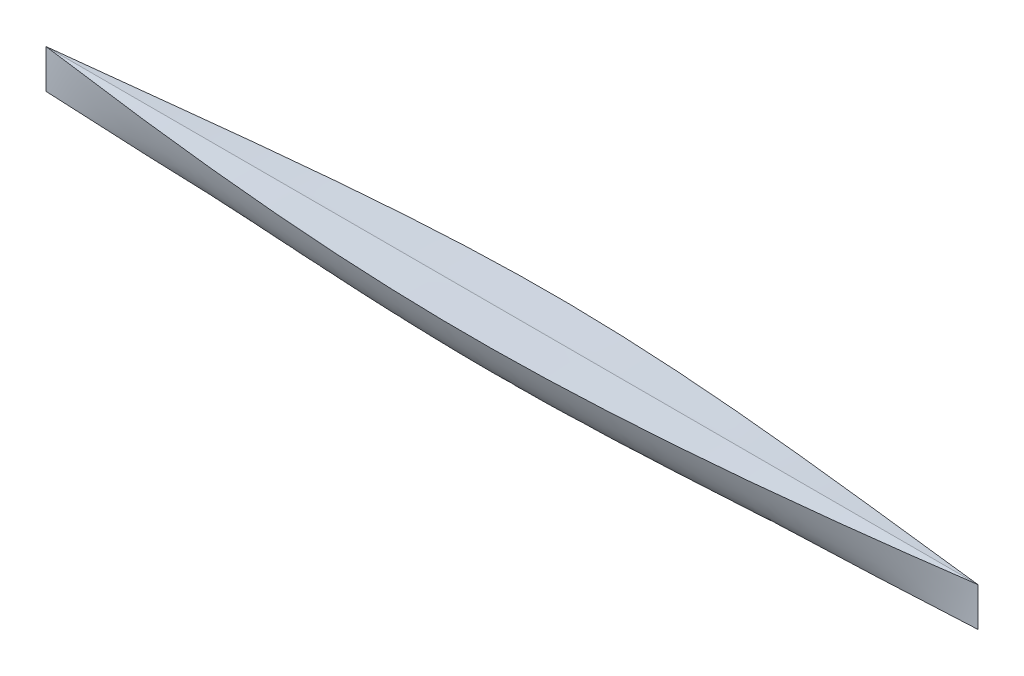
ISO-10303-21;
HEADER;
FILE_DESCRIPTION(('STEP AP214'),'2;1');
FILE_NAME('part.step','',(''),(''),'','','');
FILE_SCHEMA(('AUTOMOTIVE_DESIGN { 1 0 10303 214 1 1 1 1 }'));
ENDSEC;
DATA;
#1=APPLICATION_CONTEXT('core data for automotive mechanical design processes');
#2=APPLICATION_PROTOCOL_DEFINITION('international standard','automotive_design',2000,#1);
#3=PRODUCT_CONTEXT('',#1,'mechanical');
#4=PRODUCT('Part','Part','',(#3));
#5=PRODUCT_RELATED_PRODUCT_CATEGORY('part','',(#4));
#6=PRODUCT_DEFINITION_FORMATION('','',#4);
#7=PRODUCT_DEFINITION_CONTEXT('part definition',#1,'design');
#8=PRODUCT_DEFINITION('design','',#6,#7);
#9=PRODUCT_DEFINITION_SHAPE('','',#8);
#10=(LENGTH_UNIT() NAMED_UNIT(*) SI_UNIT(.MILLI.,.METRE.));
#11=(NAMED_UNIT(*) PLANE_ANGLE_UNIT() SI_UNIT($,.RADIAN.));
#12=(NAMED_UNIT(*) SI_UNIT($,.STERADIAN.) SOLID_ANGLE_UNIT());
#13=UNCERTAINTY_MEASURE_WITH_UNIT(LENGTH_MEASURE(1.E-05),#10,'distance_accuracy_value','');
#14=(GEOMETRIC_REPRESENTATION_CONTEXT(3) GLOBAL_UNCERTAINTY_ASSIGNED_CONTEXT((#13)) GLOBAL_UNIT_ASSIGNED_CONTEXT((#10,
#11,#12)) REPRESENTATION_CONTEXT('',''));
#15=CARTESIAN_POINT('',(0.,0.,0.));
#16=DIRECTION('',(0.,0.,1.));
#17=DIRECTION('',(1.,0.,0.));
#18=AXIS2_PLACEMENT_3D('',#15,#16,#17);
#19=CARTESIAN_POINT('',(914.4,0.,0.));
#20=CARTESIAN_POINT('',(762.,-8.46666666666661,0.));
#21=CARTESIAN_POINT('',(457.2,-16.9333333333333,0.));
#22=CARTESIAN_POINT('',(152.4,-8.46666666666668,0.));
#23=CARTESIAN_POINT('',(0.,0.,0.));
#24=CARTESIAN_POINT('',(914.4,12.7,0.));
#25=CARTESIAN_POINT('',(762.,-2.11666666676608,-6.3500000000373));
#26=CARTESIAN_POINT('',(457.2,-23.2833333336317,-19.0500000001119));
#27=CARTESIAN_POINT('',(152.4,-2.11666666676615,-6.3500000000373));
#28=CARTESIAN_POINT('',(0.,12.7,0.));
#29=CARTESIAN_POINT('',(914.4,25.4,0.));
#30=CARTESIAN_POINT('',(762.,12.6999999999006,-12.7000000000373));
#31=CARTESIAN_POINT('',(457.2,-4.23333333363175,-38.1000000001119));
#32=CARTESIAN_POINT('',(152.4,12.6999999999005,-12.7000000000373));
#33=CARTESIAN_POINT('',(0.,25.4,0.));
#34=CARTESIAN_POINT('',(914.4,38.1,0.));
#35=CARTESIAN_POINT('',(762.,35.9833333333334,-19.05));
#36=CARTESIAN_POINT('',(457.2,40.2166666666667,-57.15));
#37=CARTESIAN_POINT('',(152.4,35.9833333333333,-19.05));
#38=CARTESIAN_POINT('',(0.,38.1,0.));
#39=B_SPLINE_SURFACE_WITH_KNOTS('',3,3,((#19,#20,#21,#22,#23),(#24,#25,#26,#27,#28),(#29,#30,
#31,#32,#33),(#34,#35,#36,#37,#38)),.UNSPECIFIED.,.F.,.F.,.F.,(4,4),(4,1,4),(0.,1.),(0.,0.5,1.),.UNSPECIFIED.);
#40=DIRECTION('',(0.,1.,0.));
#41=VECTOR('',#40,1.);
#42=CARTESIAN_POINT('',(914.4,19.05,0.));
#43=LINE('',#42,#41);
#44=CARTESIAN_POINT('',(914.4,0.,0.));
#45=VERTEX_POINT('',#44);
#46=CARTESIAN_POINT('',(914.4,38.1,0.));
#47=VERTEX_POINT('',#46);
#48=EDGE_CURVE('E83',#45,#47,#43,.T.);
#49=CARTESIAN_POINT('',(914.4,0.,0.));
#50=CARTESIAN_POINT('',(762.,-8.46666666666661,0.));
#51=CARTESIAN_POINT('',(457.2,-16.9333333333333,0.));
#52=CARTESIAN_POINT('',(152.4,-8.46666666666668,0.));
#53=CARTESIAN_POINT('',(0.,0.,0.));
#54=B_SPLINE_CURVE_WITH_KNOTS('',3,(#49,#50,#51,#52,#53),.UNSPECIFIED.,.F.,.F.,(4,1,4),(0.,0.5,
1.),.UNSPECIFIED.);
#55=CARTESIAN_POINT('',(0.,0.,0.));
#56=VERTEX_POINT('',#55);
#57=EDGE_CURVE('E85',#56,#45,#54,.F.);
#58=DIRECTION('',(0.,-1.,0.));
#59=VECTOR('',#58,1.);
#60=CARTESIAN_POINT('',(0.,19.05,0.));
#61=LINE('',#60,#59);
#62=CARTESIAN_POINT('',(0.,38.1,0.));
#63=VERTEX_POINT('',#62);
#64=EDGE_CURVE('E91',#63,#56,#61,.T.);
#65=CARTESIAN_POINT('',(0.,38.1,0.));
#66=CARTESIAN_POINT('',(152.4,35.9833333333333,-19.05));
#67=CARTESIAN_POINT('',(304.8,38.1,-38.1));
#68=CARTESIAN_POINT('',(609.6,38.1,-38.1));
#69=CARTESIAN_POINT('',(762.,35.9833333333334,-19.05));
#70=CARTESIAN_POINT('',(914.4,38.1,0.));
#71=B_SPLINE_CURVE_WITH_KNOTS('',3,(#65,#66,#67,#68,#69,#70),.UNSPECIFIED.,.F.,.F.,(4,2,4),(0.,
0.5,1.),.UNSPECIFIED.);
#72=EDGE_CURVE('E12',#63,#47,#71,.T.);
#73=ORIENTED_EDGE('',*,*,#48,.F.);
#74=ORIENTED_EDGE('',*,*,#57,.F.);
#75=ORIENTED_EDGE('',*,*,#64,.F.);
#76=ORIENTED_EDGE('',*,*,#72,.T.);
#77=EDGE_LOOP('',(#73,#74,#75,#76));
#78=FACE_BOUND('',#77,.T.);
#79=ADVANCED_FACE('F55',(#78),#39,.F.);
#80=CARTESIAN_POINT('',(0.,38.1,0.));
#81=CARTESIAN_POINT('',(0.,38.1,0.));
#82=CARTESIAN_POINT('',(152.4,35.9833333333333,-19.05));
#83=CARTESIAN_POINT('',(152.4,38.1,0.));
#84=CARTESIAN_POINT('',(304.8,38.1,-38.1));
#85=CARTESIAN_POINT('',(304.800000000001,38.1,0.));
#86=CARTESIAN_POINT('',(609.6,38.1,-38.1));
#87=CARTESIAN_POINT('',(609.600000000001,38.1,0.));
#88=CARTESIAN_POINT('',(762.,35.9833333333334,-19.05));
#89=CARTESIAN_POINT('',(762.,38.1,0.));
#90=CARTESIAN_POINT('',(914.4,38.1,0.));
#91=CARTESIAN_POINT('',(914.4,38.1,0.));
#92=B_SPLINE_SURFACE_WITH_KNOTS('',3,1,((#80,#81),(#82,#83),(#84,#85),(#86,#87),(#88,#89),(#90,
#91)),.UNSPECIFIED.,.F.,.F.,.F.,(4,2,4),(2,2),(0.,0.5,1.),(0.,1.),.UNSPECIFIED.);
#93=DIRECTION('',(-1.,0.,0.));
#94=VECTOR('',#93,1.);
#95=CARTESIAN_POINT('',(457.200000000001,38.1,0.));
#96=LINE('',#95,#94);
#97=EDGE_CURVE('E75',#47,#63,#96,.T.);
#98=ORIENTED_EDGE('',*,*,#72,.F.);
#99=ORIENTED_EDGE('',*,*,#97,.F.);
#100=EDGE_LOOP('',(#98,#99));
#101=FACE_BOUND('',#100,.T.);
#102=ADVANCED_FACE('F123',(#101),#92,.F.);
#103=CARTESIAN_POINT('',(914.4,0.,0.));
#104=CARTESIAN_POINT('',(762.,-8.46666666666661,0.));
#105=CARTESIAN_POINT('',(457.2,-16.9333333333333,0.));
#106=CARTESIAN_POINT('',(152.4,-8.46666666666668,0.));
#107=CARTESIAN_POINT('',(0.,0.,0.));
#108=CARTESIAN_POINT('',(914.4,12.7,0.));
#109=CARTESIAN_POINT('',(762.,-2.11666666676608,6.3500000000373));
#110=CARTESIAN_POINT('',(457.2,-23.2833333336317,19.0500000001119));
#111=CARTESIAN_POINT('',(152.4,-2.11666666676615,6.3500000000373));
#112=CARTESIAN_POINT('',(0.,12.7,0.));
#113=CARTESIAN_POINT('',(914.4,25.4,0.));
#114=CARTESIAN_POINT('',(762.,12.6999999999006,12.7000000000373));
#115=CARTESIAN_POINT('',(457.2,-4.23333333363175,38.1000000001119));
#116=CARTESIAN_POINT('',(152.4,12.6999999999005,12.7000000000373));
#117=CARTESIAN_POINT('',(0.,25.4,0.));
#118=CARTESIAN_POINT('',(914.4,38.1,0.));
#119=CARTESIAN_POINT('',(762.,35.9833333333334,19.05));
#120=CARTESIAN_POINT('',(457.2,40.2166666666667,57.15));
#121=CARTESIAN_POINT('',(152.4,35.9833333333333,19.05));
#122=CARTESIAN_POINT('',(0.,38.1,0.));
#123=B_SPLINE_SURFACE_WITH_KNOTS('',3,3,((#103,#104,#105,#106,#107),(#108,#109,#110,#111,#112),
(#113,#114,#115,#116,#117),(#118,#119,#120,#121,#122)),.UNSPECIFIED.,.F.,.F.,.F.,(4,4),(4,1,4),
(0.,1.),(0.,0.5,1.),.UNSPECIFIED.);
#124=CARTESIAN_POINT('',(0.,38.1,0.));
#125=CARTESIAN_POINT('',(152.4,35.9833333333333,19.05));
#126=CARTESIAN_POINT('',(304.8,38.1,38.1));
#127=CARTESIAN_POINT('',(609.6,38.1,38.1));
#128=CARTESIAN_POINT('',(762.,35.9833333333334,19.05));
#129=CARTESIAN_POINT('',(914.4,38.1,0.));
#130=B_SPLINE_CURVE_WITH_KNOTS('',3,(#124,#125,#126,#127,#128,#129),.UNSPECIFIED.,.F.,.F.,(4,2,
4),(0.,0.5,1.),.UNSPECIFIED.);
#131=EDGE_CURVE('E68',#63,#47,#130,.T.);
#132=ORIENTED_EDGE('',*,*,#48,.T.);
#133=ORIENTED_EDGE('',*,*,#131,.F.);
#134=ORIENTED_EDGE('',*,*,#64,.T.);
#135=ORIENTED_EDGE('',*,*,#57,.T.);
#136=EDGE_LOOP('',(#132,#133,#134,#135));
#137=FACE_BOUND('',#136,.T.);
#138=ADVANCED_FACE('F93',(#137),#123,.T.);
#139=CARTESIAN_POINT('',(0.,38.1,0.));
#140=CARTESIAN_POINT('',(0.,38.1,0.));
#141=CARTESIAN_POINT('',(152.4,35.9833333333333,19.05));
#142=CARTESIAN_POINT('',(152.4,38.1,0.));
#143=CARTESIAN_POINT('',(304.8,38.1,38.1));
#144=CARTESIAN_POINT('',(304.800000000001,38.1,0.));
#145=CARTESIAN_POINT('',(609.6,38.1,38.1));
#146=CARTESIAN_POINT('',(609.600000000001,38.1,0.));
#147=CARTESIAN_POINT('',(762.,35.9833333333334,19.05));
#148=CARTESIAN_POINT('',(762.,38.1,0.));
#149=CARTESIAN_POINT('',(914.4,38.1,0.));
#150=CARTESIAN_POINT('',(914.4,38.1,0.));
#151=B_SPLINE_SURFACE_WITH_KNOTS('',3,1,((#139,#140),(#141,#142),(#143,#144),(#145,#146),(#147,
#148),(#149,#150)),.UNSPECIFIED.,.F.,.F.,.F.,(4,2,4),(2,2),(0.,0.5,1.),(0.,1.),.UNSPECIFIED.);
#152=ORIENTED_EDGE('',*,*,#131,.T.);
#153=ORIENTED_EDGE('',*,*,#97,.T.);
#154=EDGE_LOOP('',(#152,#153));
#155=FACE_BOUND('',#154,.T.);
#156=ADVANCED_FACE('F117',(#155),#151,.T.);
#157=CLOSED_SHELL('',(#79,#102,#138,#156));
#158=MANIFOLD_SOLID_BREP('B2',#157);
#159=ADVANCED_BREP_SHAPE_REPRESENTATION('',(#18,#158),#14);
#160=SHAPE_DEFINITION_REPRESENTATION(#9,#159);
ENDSEC;
END-ISO-10303-21;
